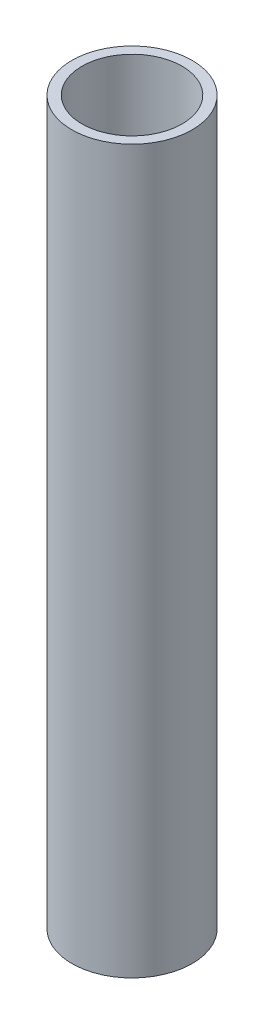
ISO-10303-21;
HEADER;
FILE_DESCRIPTION(('STEP AP214'),'2;1');
FILE_NAME('part.step','',(''),(''),'','','');
FILE_SCHEMA(('AUTOMOTIVE_DESIGN { 1 0 10303 214 1 1 1 1 }'));
ENDSEC;
DATA;
#1=APPLICATION_CONTEXT('core data for automotive mechanical design processes');
#2=APPLICATION_PROTOCOL_DEFINITION('international standard','automotive_design',2000,#1);
#3=PRODUCT_CONTEXT('',#1,'mechanical');
#4=PRODUCT('Part','Part','',(#3));
#5=PRODUCT_RELATED_PRODUCT_CATEGORY('part','',(#4));
#6=PRODUCT_DEFINITION_FORMATION('','',#4);
#7=PRODUCT_DEFINITION_CONTEXT('part definition',#1,'design');
#8=PRODUCT_DEFINITION('design','',#6,#7);
#9=PRODUCT_DEFINITION_SHAPE('','',#8);
#10=(LENGTH_UNIT() NAMED_UNIT(*) SI_UNIT(.MILLI.,.METRE.));
#11=(NAMED_UNIT(*) PLANE_ANGLE_UNIT() SI_UNIT($,.RADIAN.));
#12=(NAMED_UNIT(*) SI_UNIT($,.STERADIAN.) SOLID_ANGLE_UNIT());
#13=UNCERTAINTY_MEASURE_WITH_UNIT(LENGTH_MEASURE(1.E-05),#10,'distance_accuracy_value','');
#14=(GEOMETRIC_REPRESENTATION_CONTEXT(3) GLOBAL_UNCERTAINTY_ASSIGNED_CONTEXT((#13)) GLOBAL_UNIT_ASSIGNED_CONTEXT((#10,
#11,#12)) REPRESENTATION_CONTEXT('',''));
#15=CARTESIAN_POINT('',(0.,0.,0.));
#16=DIRECTION('',(0.,0.,1.));
#17=DIRECTION('',(1.,0.,0.));
#18=AXIS2_PLACEMENT_3D('',#15,#16,#17);
#19=CARTESIAN_POINT('',(-669.026852298777,-824.94208988364,0.));
#20=DIRECTION('',(0.,1.,0.));
#21=DIRECTION('',(0.,0.,1.));
#22=AXIS2_PLACEMENT_3D('',#19,#20,#21);
#23=CYLINDRICAL_SURFACE('',#22,5.28320000000004);
#24=CARTESIAN_POINT('',(-669.026852298777,-824.94208988364,0.));
#25=DIRECTION('',(0.,-1.,0.));
#26=DIRECTION('',(0.,0.,-1.));
#27=AXIS2_PLACEMENT_3D('',#24,#25,#26);
#28=CIRCLE('',#27,5.28320000000004);
#29=CARTESIAN_POINT('',(-669.026852298777,-824.94208988364,-5.28320000000004));
#30=VERTEX_POINT('',#29);
#31=EDGE_CURVE('E55',#30,#30,#28,.T.);
#32=ORIENTED_EDGE('',*,*,#31,.T.);
#33=EDGE_LOOP('',(#32));
#34=FACE_BOUND('',#33,.T.);
#35=CARTESIAN_POINT('',(-669.026852298777,-748.74208988364,0.));
#36=DIRECTION('',(0.,-1.,0.));
#37=DIRECTION('',(0.,0.,-1.));
#38=AXIS2_PLACEMENT_3D('',#35,#36,#37);
#39=CIRCLE('',#38,5.28320000000004);
#40=CARTESIAN_POINT('',(-669.026852298777,-748.74208988364,-5.28320000000004));
#41=VERTEX_POINT('',#40);
#42=EDGE_CURVE('E61',#41,#41,#39,.T.);
#43=ORIENTED_EDGE('',*,*,#42,.F.);
#44=EDGE_LOOP('',(#43));
#45=FACE_BOUND('',#44,.T.);
#46=ADVANCED_FACE('F48',(#34,#45),#23,.F.);
#47=CARTESIAN_POINT('',(-669.026852298777,-824.94208988364,0.));
#48=DIRECTION('',(0.,1.,0.));
#49=DIRECTION('',(0.,0.,1.));
#50=AXIS2_PLACEMENT_3D('',#47,#48,#49);
#51=CYLINDRICAL_SURFACE('',#50,6.35000000000005);
#52=CARTESIAN_POINT('',(-669.026852298777,-824.94208988364,0.));
#53=DIRECTION('',(0.,-1.,0.));
#54=DIRECTION('',(0.,0.,-1.));
#55=AXIS2_PLACEMENT_3D('',#52,#53,#54);
#56=CIRCLE('',#55,6.35000000000005);
#57=CARTESIAN_POINT('',(-669.026852298777,-824.94208988364,-6.35000000000005));
#58=VERTEX_POINT('',#57);
#59=EDGE_CURVE('E13',#58,#58,#56,.T.);
#60=ORIENTED_EDGE('',*,*,#59,.F.);
#61=EDGE_LOOP('',(#60));
#62=FACE_BOUND('',#61,.T.);
#63=CARTESIAN_POINT('',(-669.026852298777,-748.74208988364,0.));
#64=DIRECTION('',(0.,-1.,0.));
#65=DIRECTION('',(0.,0.,-1.));
#66=AXIS2_PLACEMENT_3D('',#63,#64,#65);
#67=CIRCLE('',#66,6.35000000000005);
#68=CARTESIAN_POINT('',(-669.026852298777,-748.74208988364,-6.35000000000005));
#69=VERTEX_POINT('',#68);
#70=EDGE_CURVE('E51',#69,#69,#67,.T.);
#71=ORIENTED_EDGE('',*,*,#70,.T.);
#72=EDGE_LOOP('',(#71));
#73=FACE_BOUND('',#72,.T.);
#74=ADVANCED_FACE('F68',(#62,#73),#51,.T.);
#75=CARTESIAN_POINT('',(-669.026852298777,-824.94208988364,0.));
#76=DIRECTION('',(0.,-1.,0.));
#77=DIRECTION('',(0.,0.,-1.));
#78=AXIS2_PLACEMENT_3D('',#75,#76,#77);
#79=PLANE('',#78);
#80=ORIENTED_EDGE('',*,*,#31,.F.);
#81=EDGE_LOOP('',(#80));
#82=FACE_BOUND('',#81,.T.);
#83=ORIENTED_EDGE('',*,*,#59,.T.);
#84=EDGE_LOOP('',(#83));
#85=FACE_BOUND('',#84,.T.);
#86=ADVANCED_FACE('F72',(#82,#85),#79,.T.);
#87=CARTESIAN_POINT('',(-669.026852298777,-748.74208988364,0.));
#88=DIRECTION('',(0.,-1.,0.));
#89=DIRECTION('',(0.,0.,-1.));
#90=AXIS2_PLACEMENT_3D('',#87,#88,#89);
#91=PLANE('',#90);
#92=ORIENTED_EDGE('',*,*,#42,.T.);
#93=EDGE_LOOP('',(#92));
#94=FACE_BOUND('',#93,.T.);
#95=ORIENTED_EDGE('',*,*,#70,.F.);
#96=EDGE_LOOP('',(#95));
#97=FACE_BOUND('',#96,.T.);
#98=ADVANCED_FACE('F70',(#94,#97),#91,.F.);
#99=CLOSED_SHELL('',(#46,#74,#86,#98));
#100=MANIFOLD_SOLID_BREP('B2',#99);
#101=ADVANCED_BREP_SHAPE_REPRESENTATION('',(#18,#100),#14);
#102=SHAPE_DEFINITION_REPRESENTATION(#9,#101);
ENDSEC;
END-ISO-10303-21;
